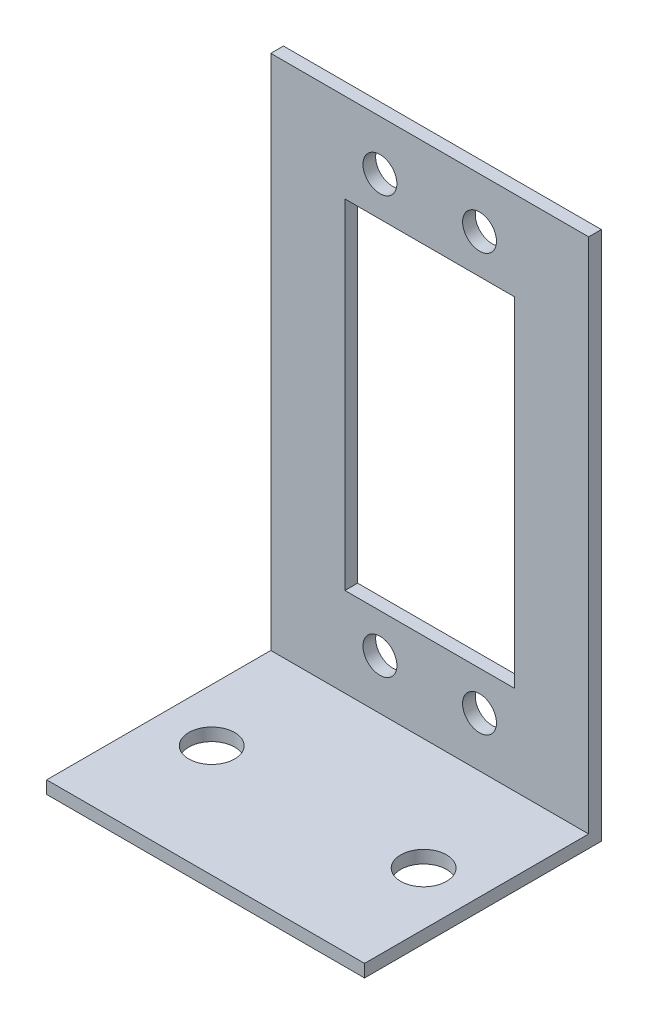
ISO-10303-21;
HEADER;
FILE_DESCRIPTION(('STEP AP214'),'2;1');
FILE_NAME('part.step','',(''),(''),'','','');
FILE_SCHEMA(('AUTOMOTIVE_DESIGN { 1 0 10303 214 1 1 1 1 }'));
ENDSEC;
DATA;
#1=APPLICATION_CONTEXT('core data for automotive mechanical design processes');
#2=APPLICATION_PROTOCOL_DEFINITION('international standard','automotive_design',2000,#1);
#3=PRODUCT_CONTEXT('',#1,'mechanical');
#4=PRODUCT('Part','Part','',(#3));
#5=PRODUCT_RELATED_PRODUCT_CATEGORY('part','',(#4));
#6=PRODUCT_DEFINITION_FORMATION('','',#4);
#7=PRODUCT_DEFINITION_CONTEXT('part definition',#1,'design');
#8=PRODUCT_DEFINITION('design','',#6,#7);
#9=PRODUCT_DEFINITION_SHAPE('','',#8);
#10=(LENGTH_UNIT() NAMED_UNIT(*) SI_UNIT(.MILLI.,.METRE.));
#11=(NAMED_UNIT(*) PLANE_ANGLE_UNIT() SI_UNIT($,.RADIAN.));
#12=(NAMED_UNIT(*) SI_UNIT($,.STERADIAN.) SOLID_ANGLE_UNIT());
#13=UNCERTAINTY_MEASURE_WITH_UNIT(LENGTH_MEASURE(1.E-05),#10,'distance_accuracy_value','');
#14=(GEOMETRIC_REPRESENTATION_CONTEXT(3) GLOBAL_UNCERTAINTY_ASSIGNED_CONTEXT((#13)) GLOBAL_UNIT_ASSIGNED_CONTEXT((#10,
#11,#12)) REPRESENTATION_CONTEXT('',''));
#15=CARTESIAN_POINT('',(0.,0.,0.));
#16=DIRECTION('',(0.,0.,1.));
#17=DIRECTION('',(1.,0.,0.));
#18=AXIS2_PLACEMENT_3D('',#15,#16,#17);
#19=CARTESIAN_POINT('',(19.05,1.51892,0.));
#20=DIRECTION('',(0.,0.,-1.));
#21=DIRECTION('',(0.,1.,0.));
#22=AXIS2_PLACEMENT_3D('',#19,#20,#21);
#23=PLANE('',#22);
#24=DIRECTION('',(0.,-1.,0.));
#25=VECTOR('',#24,1.);
#26=CARTESIAN_POINT('',(-19.05,1.51892,0.));
#27=LINE('',#26,#25);
#28=CARTESIAN_POINT('',(-19.05,1.51892,0.));
#29=VERTEX_POINT('',#28);
#30=CARTESIAN_POINT('',(-19.05,0.,0.));
#31=VERTEX_POINT('',#30);
#32=EDGE_CURVE('E156',#29,#31,#27,.T.);
#33=ORIENTED_EDGE('',*,*,#32,.T.);
#34=DIRECTION('',(-1.,0.,0.));
#35=VECTOR('',#34,1.);
#36=CARTESIAN_POINT('',(19.05,0.,0.));
#37=LINE('',#36,#35);
#38=CARTESIAN_POINT('',(19.05,0.,0.));
#39=VERTEX_POINT('',#38);
#40=EDGE_CURVE('E11',#39,#31,#37,.T.);
#41=ORIENTED_EDGE('',*,*,#40,.F.);
#42=DIRECTION('',(0.,-1.,0.));
#43=VECTOR('',#42,1.);
#44=CARTESIAN_POINT('',(19.05,1.51892,0.));
#45=LINE('',#44,#43);
#46=CARTESIAN_POINT('',(19.05,1.51892,0.));
#47=VERTEX_POINT('',#46);
#48=EDGE_CURVE('E157',#47,#39,#45,.T.);
#49=ORIENTED_EDGE('',*,*,#48,.F.);
#50=DIRECTION('',(-1.,0.,0.));
#51=VECTOR('',#50,1.);
#52=CARTESIAN_POINT('',(19.05,1.51892,0.));
#53=LINE('',#52,#51);
#54=EDGE_CURVE('E171',#47,#29,#53,.T.);
#55=ORIENTED_EDGE('',*,*,#54,.T.);
#56=EDGE_LOOP('',(#33,#41,#49,#55));
#57=FACE_BOUND('',#56,.T.);
#58=ADVANCED_FACE('F32',(#57),#23,.F.);
#59=CARTESIAN_POINT('',(19.05,0.,0.));
#60=DIRECTION('',(0.,1.,0.));
#61=DIRECTION('',(0.,0.,1.));
#62=AXIS2_PLACEMENT_3D('',#59,#60,#61);
#63=PLANE('',#62);
#64=CARTESIAN_POINT('',(-12.7,0.,-13.430846122449));
#65=DIRECTION('',(0.,1.,0.));
#66=DIRECTION('',(0.,0.,1.));
#67=AXIS2_PLACEMENT_3D('',#64,#65,#66);
#68=CIRCLE('',#67,2.75);
#69=CARTESIAN_POINT('',(-12.7,0.,-10.680846122449));
#70=VERTEX_POINT('',#69);
#71=EDGE_CURVE('E147',#70,#70,#68,.T.);
#72=ORIENTED_EDGE('',*,*,#71,.T.);
#73=EDGE_LOOP('',(#72));
#74=FACE_BOUND('',#73,.T.);
#75=CARTESIAN_POINT('',(12.7,0.,-13.430846122449));
#76=DIRECTION('',(0.,1.,0.));
#77=DIRECTION('',(0.,0.,1.));
#78=AXIS2_PLACEMENT_3D('',#75,#76,#77);
#79=CIRCLE('',#78,2.75);
#80=CARTESIAN_POINT('',(12.7,0.,-10.680846122449));
#81=VERTEX_POINT('',#80);
#82=EDGE_CURVE('E153',#81,#81,#79,.T.);
#83=ORIENTED_EDGE('',*,*,#82,.T.);
#84=EDGE_LOOP('',(#83));
#85=FACE_BOUND('',#84,.T.);
#86=DIRECTION('',(0.,0.,-1.));
#87=VECTOR('',#86,1.);
#88=CARTESIAN_POINT('',(-19.05,0.,0.));
#89=LINE('',#88,#87);
#90=CARTESIAN_POINT('',(-19.05,0.,-28.3806122448979));
#91=VERTEX_POINT('',#90);
#92=EDGE_CURVE('E174',#31,#91,#89,.T.);
#93=ORIENTED_EDGE('',*,*,#92,.T.);
#94=DIRECTION('',(-1.,0.,0.));
#95=VECTOR('',#94,1.);
#96=CARTESIAN_POINT('',(19.05,0.,-28.3806122448979));
#97=LINE('',#96,#95);
#98=CARTESIAN_POINT('',(19.05,0.,-28.3806122448979));
#99=VERTEX_POINT('',#98);
#100=EDGE_CURVE('E39',#99,#91,#97,.T.);
#101=ORIENTED_EDGE('',*,*,#100,.F.);
#102=DIRECTION('',(0.,0.,-1.));
#103=VECTOR('',#102,1.);
#104=CARTESIAN_POINT('',(19.05,0.,0.));
#105=LINE('',#104,#103);
#106=EDGE_CURVE('E160',#39,#99,#105,.T.);
#107=ORIENTED_EDGE('',*,*,#106,.F.);
#108=ORIENTED_EDGE('',*,*,#40,.T.);
#109=EDGE_LOOP('',(#93,#101,#107,#108));
#110=FACE_BOUND('',#109,.T.);
#111=ADVANCED_FACE('F219',(#74,#85,#110),#63,.F.);
#112=CARTESIAN_POINT('',(19.05,0.,-28.3806122448979));
#113=DIRECTION('',(0.,0.,1.));
#114=DIRECTION('',(1.,0.,0.));
#115=AXIS2_PLACEMENT_3D('',#112,#113,#114);
#116=PLANE('',#115);
#117=CARTESIAN_POINT('',(5.969,57.50946,-28.3806122448979));
#118=DIRECTION('',(0.,0.,1.));
#119=DIRECTION('',(1.,0.,0.));
#120=AXIS2_PLACEMENT_3D('',#117,#118,#119);
#121=CIRCLE('',#120,2.032);
#122=CARTESIAN_POINT('',(8.001,57.50946,-28.3806122448979));
#123=VERTEX_POINT('',#122);
#124=EDGE_CURVE('E401',#123,#123,#121,.F.);
#125=ORIENTED_EDGE('',*,*,#124,.F.);
#126=EDGE_LOOP('',(#125));
#127=FACE_BOUND('',#126,.T.);
#128=CARTESIAN_POINT('',(-5.969,7.50946000000001,-28.3806122448979));
#129=DIRECTION('',(0.,0.,1.));
#130=DIRECTION('',(1.,0.,0.));
#131=AXIS2_PLACEMENT_3D('',#128,#129,#130);
#132=CIRCLE('',#131,2.032);
#133=CARTESIAN_POINT('',(-3.937,7.50946000000001,-28.3806122448979));
#134=VERTEX_POINT('',#133);
#135=EDGE_CURVE('E402',#134,#134,#132,.F.);
#136=ORIENTED_EDGE('',*,*,#135,.F.);
#137=EDGE_LOOP('',(#136));
#138=FACE_BOUND('',#137,.T.);
#139=CARTESIAN_POINT('',(5.969,7.50946000000001,-28.3806122448979));
#140=DIRECTION('',(0.,0.,1.));
#141=DIRECTION('',(1.,0.,0.));
#142=AXIS2_PLACEMENT_3D('',#139,#140,#141);
#143=CIRCLE('',#142,2.032);
#144=CARTESIAN_POINT('',(8.001,7.50946000000001,-28.3806122448979));
#145=VERTEX_POINT('',#144);
#146=EDGE_CURVE('E409',#145,#145,#143,.F.);
#147=ORIENTED_EDGE('',*,*,#146,.F.);
#148=EDGE_LOOP('',(#147));
#149=FACE_BOUND('',#148,.T.);
#150=CARTESIAN_POINT('',(-5.969,57.50946,-28.3806122448979));
#151=DIRECTION('',(0.,0.,1.));
#152=DIRECTION('',(1.,0.,0.));
#153=AXIS2_PLACEMENT_3D('',#150,#151,#152);
#154=CIRCLE('',#153,2.032);
#155=CARTESIAN_POINT('',(-3.937,57.50946,-28.3806122448979));
#156=VERTEX_POINT('',#155);
#157=EDGE_CURVE('E394',#156,#156,#154,.F.);
#158=ORIENTED_EDGE('',*,*,#157,.F.);
#159=EDGE_LOOP('',(#158));
#160=FACE_BOUND('',#159,.T.);
#161=DIRECTION('',(-1.,0.,0.));
#162=VECTOR('',#161,1.);
#163=CARTESIAN_POINT('',(-10.16,12.18946,-28.3806122448979));
#164=LINE('',#163,#162);
#165=CARTESIAN_POINT('',(10.16,12.18946,-28.3806122448979));
#166=VERTEX_POINT('',#165);
#167=CARTESIAN_POINT('',(-10.16,12.18946,-28.3806122448979));
#168=VERTEX_POINT('',#167);
#169=EDGE_CURVE('E128',#166,#168,#164,.T.);
#170=ORIENTED_EDGE('',*,*,#169,.F.);
#171=DIRECTION('',(0.,-1.,0.));
#172=VECTOR('',#171,1.);
#173=CARTESIAN_POINT('',(10.16,52.82946,-28.3806122448979));
#174=LINE('',#173,#172);
#175=CARTESIAN_POINT('',(10.16,52.82946,-28.3806122448979));
#176=VERTEX_POINT('',#175);
#177=EDGE_CURVE('E110',#176,#166,#174,.T.);
#178=ORIENTED_EDGE('',*,*,#177,.F.);
#179=DIRECTION('',(1.,0.,0.));
#180=VECTOR('',#179,1.);
#181=CARTESIAN_POINT('',(-10.16,52.82946,-28.3806122448979));
#182=LINE('',#181,#180);
#183=CARTESIAN_POINT('',(-10.16,52.82946,-28.3806122448979));
#184=VERTEX_POINT('',#183);
#185=EDGE_CURVE('E119',#184,#176,#182,.T.);
#186=ORIENTED_EDGE('',*,*,#185,.F.);
#187=DIRECTION('',(0.,1.,0.));
#188=VECTOR('',#187,1.);
#189=CARTESIAN_POINT('',(-10.16,52.82946,-28.3806122448979));
#190=LINE('',#189,#188);
#191=EDGE_CURVE('E46',#168,#184,#190,.T.);
#192=ORIENTED_EDGE('',*,*,#191,.F.);
#193=EDGE_LOOP('',(#170,#178,#186,#192));
#194=FACE_BOUND('',#193,.T.);
#195=DIRECTION('',(0.,1.,0.));
#196=VECTOR('',#195,1.);
#197=CARTESIAN_POINT('',(-19.05,0.,-28.3806122448979));
#198=LINE('',#197,#196);
#199=CARTESIAN_POINT('',(-19.05,63.5,-28.3806122448979));
#200=VERTEX_POINT('',#199);
#201=EDGE_CURVE('E176',#91,#200,#198,.T.);
#202=ORIENTED_EDGE('',*,*,#201,.T.);
#203=DIRECTION('',(-1.,0.,0.));
#204=VECTOR('',#203,1.);
#205=CARTESIAN_POINT('',(19.05,63.5,-28.3806122448979));
#206=LINE('',#205,#204);
#207=CARTESIAN_POINT('',(19.05,63.5,-28.3806122448979));
#208=VERTEX_POINT('',#207);
#209=EDGE_CURVE('E191',#208,#200,#206,.T.);
#210=ORIENTED_EDGE('',*,*,#209,.F.);
#211=DIRECTION('',(0.,1.,0.));
#212=VECTOR('',#211,1.);
#213=CARTESIAN_POINT('',(19.05,0.,-28.3806122448979));
#214=LINE('',#213,#212);
#215=EDGE_CURVE('E163',#99,#208,#214,.T.);
#216=ORIENTED_EDGE('',*,*,#215,.F.);
#217=ORIENTED_EDGE('',*,*,#100,.T.);
#218=EDGE_LOOP('',(#202,#210,#216,#217));
#219=FACE_BOUND('',#218,.T.);
#220=ADVANCED_FACE('F125',(#127,#138,#149,#160,#194,#219),#116,.F.);
#221=CARTESIAN_POINT('',(19.05,63.5,-28.3806122448979));
#222=DIRECTION('',(0.,-1.,0.));
#223=DIRECTION('',(0.,0.,-1.));
#224=AXIS2_PLACEMENT_3D('',#221,#222,#223);
#225=PLANE('',#224);
#226=DIRECTION('',(0.,0.,1.));
#227=VECTOR('',#226,1.);
#228=CARTESIAN_POINT('',(-19.05,63.5,-28.3806122448979));
#229=LINE('',#228,#227);
#230=CARTESIAN_POINT('',(-19.05,63.5,-26.8616922448979));
#231=VERTEX_POINT('',#230);
#232=EDGE_CURVE('E178',#200,#231,#229,.T.);
#233=ORIENTED_EDGE('',*,*,#232,.T.);
#234=DIRECTION('',(-1.,0.,0.));
#235=VECTOR('',#234,1.);
#236=CARTESIAN_POINT('',(19.05,63.5,-26.8616922448979));
#237=LINE('',#236,#235);
#238=CARTESIAN_POINT('',(19.05,63.5,-26.8616922448979));
#239=VERTEX_POINT('',#238);
#240=EDGE_CURVE('E188',#239,#231,#237,.T.);
#241=ORIENTED_EDGE('',*,*,#240,.F.);
#242=DIRECTION('',(0.,0.,1.));
#243=VECTOR('',#242,1.);
#244=CARTESIAN_POINT('',(19.05,63.5,-28.3806122448979));
#245=LINE('',#244,#243);
#246=EDGE_CURVE('E165',#208,#239,#245,.T.);
#247=ORIENTED_EDGE('',*,*,#246,.F.);
#248=ORIENTED_EDGE('',*,*,#209,.T.);
#249=EDGE_LOOP('',(#233,#241,#247,#248));
#250=FACE_BOUND('',#249,.T.);
#251=ADVANCED_FACE('F207',(#250),#225,.F.);
#252=CARTESIAN_POINT('',(19.05,63.5,-26.8616922448979));
#253=DIRECTION('',(0.,0.,-1.));
#254=DIRECTION('',(0.,1.,0.));
#255=AXIS2_PLACEMENT_3D('',#252,#253,#254);
#256=PLANE('',#255);
#257=CARTESIAN_POINT('',(5.969,57.50946,-26.8616922448979));
#258=DIRECTION('',(0.,0.,1.));
#259=DIRECTION('',(1.,0.,0.));
#260=AXIS2_PLACEMENT_3D('',#257,#258,#259);
#261=CIRCLE('',#260,2.032);
#262=CARTESIAN_POINT('',(8.001,57.50946,-26.8616922448979));
#263=VERTEX_POINT('',#262);
#264=EDGE_CURVE('E405',#263,#263,#261,.T.);
#265=ORIENTED_EDGE('',*,*,#264,.F.);
#266=EDGE_LOOP('',(#265));
#267=FACE_BOUND('',#266,.T.);
#268=CARTESIAN_POINT('',(-5.969,7.50946000000001,-26.8616922448979));
#269=DIRECTION('',(0.,0.,1.));
#270=DIRECTION('',(-1.,0.,0.));
#271=AXIS2_PLACEMENT_3D('',#268,#269,#270);
#272=CIRCLE('',#271,2.032);
#273=CARTESIAN_POINT('',(-8.001,7.50946000000001,-26.8616922448979));
#274=VERTEX_POINT('',#273);
#275=EDGE_CURVE('E406',#274,#274,#272,.T.);
#276=ORIENTED_EDGE('',*,*,#275,.F.);
#277=EDGE_LOOP('',(#276));
#278=FACE_BOUND('',#277,.T.);
#279=CARTESIAN_POINT('',(5.969,7.50946000000001,-26.8616922448979));
#280=DIRECTION('',(0.,0.,1.));
#281=DIRECTION('',(-1.,0.,0.));
#282=AXIS2_PLACEMENT_3D('',#279,#280,#281);
#283=CIRCLE('',#282,2.032);
#284=CARTESIAN_POINT('',(3.937,7.50946000000001,-26.8616922448979));
#285=VERTEX_POINT('',#284);
#286=EDGE_CURVE('E415',#285,#285,#283,.T.);
#287=ORIENTED_EDGE('',*,*,#286,.F.);
#288=EDGE_LOOP('',(#287));
#289=FACE_BOUND('',#288,.T.);
#290=CARTESIAN_POINT('',(-5.969,57.50946,-26.8616922448979));
#291=DIRECTION('',(0.,0.,1.));
#292=DIRECTION('',(1.,0.,0.));
#293=AXIS2_PLACEMENT_3D('',#290,#291,#292);
#294=CIRCLE('',#293,2.032);
#295=CARTESIAN_POINT('',(-3.937,57.50946,-26.8616922448979));
#296=VERTEX_POINT('',#295);
#297=EDGE_CURVE('E396',#296,#296,#294,.T.);
#298=ORIENTED_EDGE('',*,*,#297,.F.);
#299=EDGE_LOOP('',(#298));
#300=FACE_BOUND('',#299,.T.);
#301=DIRECTION('',(-1.,0.,0.));
#302=VECTOR('',#301,1.);
#303=CARTESIAN_POINT('',(-10.16,52.82946,-26.8616922448979));
#304=LINE('',#303,#302);
#305=CARTESIAN_POINT('',(10.16,52.82946,-26.8616922448979));
#306=VERTEX_POINT('',#305);
#307=CARTESIAN_POINT('',(-10.16,52.82946,-26.8616922448979));
#308=VERTEX_POINT('',#307);
#309=EDGE_CURVE('E130',#306,#308,#304,.T.);
#310=ORIENTED_EDGE('',*,*,#309,.F.);
#311=DIRECTION('',(0.,1.,0.));
#312=VECTOR('',#311,1.);
#313=CARTESIAN_POINT('',(10.16,52.82946,-26.8616922448979));
#314=LINE('',#313,#312);
#315=CARTESIAN_POINT('',(10.16,12.18946,-26.8616922448979));
#316=VERTEX_POINT('',#315);
#317=EDGE_CURVE('E54',#316,#306,#314,.T.);
#318=ORIENTED_EDGE('',*,*,#317,.F.);
#319=DIRECTION('',(1.,0.,0.));
#320=VECTOR('',#319,1.);
#321=CARTESIAN_POINT('',(-10.16,12.18946,-26.8616922448979));
#322=LINE('',#321,#320);
#323=CARTESIAN_POINT('',(-10.16,12.18946,-26.8616922448979));
#324=VERTEX_POINT('',#323);
#325=EDGE_CURVE('E116',#324,#316,#322,.T.);
#326=ORIENTED_EDGE('',*,*,#325,.F.);
#327=DIRECTION('',(0.,-1.,0.));
#328=VECTOR('',#327,1.);
#329=CARTESIAN_POINT('',(-10.16,52.82946,-26.8616922448979));
#330=LINE('',#329,#328);
#331=EDGE_CURVE('E136',#308,#324,#330,.T.);
#332=ORIENTED_EDGE('',*,*,#331,.F.);
#333=EDGE_LOOP('',(#310,#318,#326,#332));
#334=FACE_BOUND('',#333,.T.);
#335=DIRECTION('',(0.,-1.,0.));
#336=VECTOR('',#335,1.);
#337=CARTESIAN_POINT('',(-19.05,63.5,-26.8616922448979));
#338=LINE('',#337,#336);
#339=CARTESIAN_POINT('',(-19.05,1.51892,-26.8616922448979));
#340=VERTEX_POINT('',#339);
#341=EDGE_CURVE('E180',#231,#340,#338,.T.);
#342=ORIENTED_EDGE('',*,*,#341,.T.);
#343=DIRECTION('',(-1.,0.,0.));
#344=VECTOR('',#343,1.);
#345=CARTESIAN_POINT('',(19.05,1.51892,-26.8616922448979));
#346=LINE('',#345,#344);
#347=CARTESIAN_POINT('',(19.05,1.51892,-26.8616922448979));
#348=VERTEX_POINT('',#347);
#349=EDGE_CURVE('E185',#348,#340,#346,.T.);
#350=ORIENTED_EDGE('',*,*,#349,.F.);
#351=DIRECTION('',(0.,-1.,0.));
#352=VECTOR('',#351,1.);
#353=CARTESIAN_POINT('',(19.05,63.5,-26.8616922448979));
#354=LINE('',#353,#352);
#355=EDGE_CURVE('E167',#239,#348,#354,.T.);
#356=ORIENTED_EDGE('',*,*,#355,.F.);
#357=ORIENTED_EDGE('',*,*,#240,.T.);
#358=EDGE_LOOP('',(#342,#350,#356,#357));
#359=FACE_BOUND('',#358,.T.);
#360=ADVANCED_FACE('F211',(#267,#278,#289,#300,#334,#359),#256,.F.);
#361=CARTESIAN_POINT('',(19.05,1.51892,-26.8616922448979));
#362=DIRECTION('',(0.,-1.,0.));
#363=DIRECTION('',(0.,0.,-1.));
#364=AXIS2_PLACEMENT_3D('',#361,#362,#363);
#365=PLANE('',#364);
#366=CARTESIAN_POINT('',(-12.7,1.51892,-13.430846122449));
#367=DIRECTION('',(0.,1.,0.));
#368=DIRECTION('',(0.,0.,1.));
#369=AXIS2_PLACEMENT_3D('',#366,#367,#368);
#370=CIRCLE('',#369,2.75);
#371=CARTESIAN_POINT('',(-12.7,1.51892,-10.680846122449));
#372=VERTEX_POINT('',#371);
#373=EDGE_CURVE('E122',#372,#372,#370,.T.);
#374=ORIENTED_EDGE('',*,*,#373,.F.);
#375=EDGE_LOOP('',(#374));
#376=FACE_BOUND('',#375,.T.);
#377=CARTESIAN_POINT('',(12.7,1.51892,-13.430846122449));
#378=DIRECTION('',(0.,1.,0.));
#379=DIRECTION('',(0.,0.,1.));
#380=AXIS2_PLACEMENT_3D('',#377,#378,#379);
#381=CIRCLE('',#380,2.75);
#382=CARTESIAN_POINT('',(12.7,1.51892,-10.680846122449));
#383=VERTEX_POINT('',#382);
#384=EDGE_CURVE('E150',#383,#383,#381,.T.);
#385=ORIENTED_EDGE('',*,*,#384,.F.);
#386=EDGE_LOOP('',(#385));
#387=FACE_BOUND('',#386,.T.);
#388=DIRECTION('',(0.,0.,1.));
#389=VECTOR('',#388,1.);
#390=CARTESIAN_POINT('',(-19.05,1.51892,-26.8616922448979));
#391=LINE('',#390,#389);
#392=EDGE_CURVE('E161',#340,#29,#391,.T.);
#393=ORIENTED_EDGE('',*,*,#392,.T.);
#394=ORIENTED_EDGE('',*,*,#54,.F.);
#395=DIRECTION('',(0.,0.,1.));
#396=VECTOR('',#395,1.);
#397=CARTESIAN_POINT('',(19.05,1.51892,-26.8616922448979));
#398=LINE('',#397,#396);
#399=EDGE_CURVE('E169',#348,#47,#398,.T.);
#400=ORIENTED_EDGE('',*,*,#399,.F.);
#401=ORIENTED_EDGE('',*,*,#349,.T.);
#402=EDGE_LOOP('',(#393,#394,#400,#401));
#403=FACE_BOUND('',#402,.T.);
#404=ADVANCED_FACE('F222',(#376,#387,#403),#365,.F.);
#405=CARTESIAN_POINT('',(19.05,0.,0.));
#406=DIRECTION('',(1.,0.,0.));
#407=DIRECTION('',(0.,0.,-1.));
#408=AXIS2_PLACEMENT_3D('',#405,#406,#407);
#409=PLANE('',#408);
#410=ORIENTED_EDGE('',*,*,#48,.T.);
#411=ORIENTED_EDGE('',*,*,#106,.T.);
#412=ORIENTED_EDGE('',*,*,#215,.T.);
#413=ORIENTED_EDGE('',*,*,#246,.T.);
#414=ORIENTED_EDGE('',*,*,#355,.T.);
#415=ORIENTED_EDGE('',*,*,#399,.T.);
#416=EDGE_LOOP('',(#410,#411,#412,#413,#414,#415));
#417=FACE_BOUND('',#416,.T.);
#418=ADVANCED_FACE('F215',(#417),#409,.T.);
#419=CARTESIAN_POINT('',(-19.05,0.,0.));
#420=DIRECTION('',(1.,0.,0.));
#421=DIRECTION('',(0.,0.,-1.));
#422=AXIS2_PLACEMENT_3D('',#419,#420,#421);
#423=PLANE('',#422);
#424=ORIENTED_EDGE('',*,*,#32,.F.);
#425=ORIENTED_EDGE('',*,*,#392,.F.);
#426=ORIENTED_EDGE('',*,*,#341,.F.);
#427=ORIENTED_EDGE('',*,*,#232,.F.);
#428=ORIENTED_EDGE('',*,*,#201,.F.);
#429=ORIENTED_EDGE('',*,*,#92,.F.);
#430=EDGE_LOOP('',(#424,#425,#426,#427,#428,#429));
#431=FACE_BOUND('',#430,.T.);
#432=ADVANCED_FACE('F202',(#431),#423,.F.);
#433=CARTESIAN_POINT('',(12.7,1.51892,-13.430846122449));
#434=DIRECTION('',(0.,1.,0.));
#435=DIRECTION('',(0.,0.,1.));
#436=AXIS2_PLACEMENT_3D('',#433,#434,#435);
#437=CYLINDRICAL_SURFACE('',#436,2.75);
#438=ORIENTED_EDGE('',*,*,#82,.F.);
#439=EDGE_LOOP('',(#438));
#440=FACE_BOUND('',#439,.T.);
#441=ORIENTED_EDGE('',*,*,#384,.T.);
#442=EDGE_LOOP('',(#441));
#443=FACE_BOUND('',#442,.T.);
#444=ADVANCED_FACE('F324',(#440,#443),#437,.F.);
#445=CARTESIAN_POINT('',(-12.7,1.51892,-13.430846122449));
#446=DIRECTION('',(0.,1.,0.));
#447=DIRECTION('',(0.,0.,1.));
#448=AXIS2_PLACEMENT_3D('',#445,#446,#447);
#449=CYLINDRICAL_SURFACE('',#448,2.75);
#450=ORIENTED_EDGE('',*,*,#71,.F.);
#451=EDGE_LOOP('',(#450));
#452=FACE_BOUND('',#451,.T.);
#453=ORIENTED_EDGE('',*,*,#373,.T.);
#454=EDGE_LOOP('',(#453));
#455=FACE_BOUND('',#454,.T.);
#456=ADVANCED_FACE('F321',(#452,#455),#449,.F.);
#457=CARTESIAN_POINT('',(10.16,52.82946,-28.3816122448979));
#458=DIRECTION('',(1.,0.,0.));
#459=DIRECTION('',(0.,1.,0.));
#460=AXIS2_PLACEMENT_3D('',#457,#458,#459);
#461=PLANE('',#460);
#462=ORIENTED_EDGE('',*,*,#177,.T.);
#463=DIRECTION('',(0.,0.,1.));
#464=VECTOR('',#463,1.);
#465=CARTESIAN_POINT('',(10.16,12.18946,-28.3816122448979));
#466=LINE('',#465,#464);
#467=EDGE_CURVE('E123',#166,#316,#466,.T.);
#468=ORIENTED_EDGE('',*,*,#467,.T.);
#469=ORIENTED_EDGE('',*,*,#317,.T.);
#470=DIRECTION('',(0.,0.,1.));
#471=VECTOR('',#470,1.);
#472=CARTESIAN_POINT('',(10.16,52.82946,-28.3816122448979));
#473=LINE('',#472,#471);
#474=EDGE_CURVE('E106',#176,#306,#473,.T.);
#475=ORIENTED_EDGE('',*,*,#474,.F.);
#476=EDGE_LOOP('',(#462,#468,#469,#475));
#477=FACE_BOUND('',#476,.T.);
#478=ADVANCED_FACE('F108',(#477),#461,.F.);
#479=CARTESIAN_POINT('',(-10.16,12.18946,-28.3816122448979));
#480=DIRECTION('',(0.,-1.,0.));
#481=DIRECTION('',(0.,0.,-1.));
#482=AXIS2_PLACEMENT_3D('',#479,#480,#481);
#483=PLANE('',#482);
#484=ORIENTED_EDGE('',*,*,#169,.T.);
#485=DIRECTION('',(0.,0.,1.));
#486=VECTOR('',#485,1.);
#487=CARTESIAN_POINT('',(-10.16,12.18946,-28.3816122448979));
#488=LINE('',#487,#486);
#489=EDGE_CURVE('E142',#168,#324,#488,.T.);
#490=ORIENTED_EDGE('',*,*,#489,.T.);
#491=ORIENTED_EDGE('',*,*,#325,.T.);
#492=ORIENTED_EDGE('',*,*,#467,.F.);
#493=EDGE_LOOP('',(#484,#490,#491,#492));
#494=FACE_BOUND('',#493,.T.);
#495=ADVANCED_FACE('F311',(#494),#483,.F.);
#496=CARTESIAN_POINT('',(-10.16,52.82946,-28.3816122448979));
#497=DIRECTION('',(-1.,0.,0.));
#498=DIRECTION('',(0.,-1.,0.));
#499=AXIS2_PLACEMENT_3D('',#496,#497,#498);
#500=PLANE('',#499);
#501=ORIENTED_EDGE('',*,*,#191,.T.);
#502=DIRECTION('',(0.,0.,1.));
#503=VECTOR('',#502,1.);
#504=CARTESIAN_POINT('',(-10.16,52.82946,-28.3816122448979));
#505=LINE('',#504,#503);
#506=EDGE_CURVE('E115',#184,#308,#505,.T.);
#507=ORIENTED_EDGE('',*,*,#506,.T.);
#508=ORIENTED_EDGE('',*,*,#331,.T.);
#509=ORIENTED_EDGE('',*,*,#489,.F.);
#510=EDGE_LOOP('',(#501,#507,#508,#509));
#511=FACE_BOUND('',#510,.T.);
#512=ADVANCED_FACE('F314',(#511),#500,.F.);
#513=CARTESIAN_POINT('',(-10.16,52.82946,-28.3816122448979));
#514=DIRECTION('',(0.,1.,0.));
#515=DIRECTION('',(0.,0.,1.));
#516=AXIS2_PLACEMENT_3D('',#513,#514,#515);
#517=PLANE('',#516);
#518=ORIENTED_EDGE('',*,*,#185,.T.);
#519=ORIENTED_EDGE('',*,*,#474,.T.);
#520=ORIENTED_EDGE('',*,*,#309,.T.);
#521=ORIENTED_EDGE('',*,*,#506,.F.);
#522=EDGE_LOOP('',(#518,#519,#520,#521));
#523=FACE_BOUND('',#522,.T.);
#524=ADVANCED_FACE('F120',(#523),#517,.F.);
#525=CARTESIAN_POINT('',(-5.969,57.50946,-28.3816122448979));
#526=DIRECTION('',(0.,0.,1.));
#527=DIRECTION('',(1.,0.,0.));
#528=AXIS2_PLACEMENT_3D('',#525,#526,#527);
#529=CYLINDRICAL_SURFACE('',#528,2.032);
#530=ORIENTED_EDGE('',*,*,#297,.T.);
#531=EDGE_LOOP('',(#530));
#532=FACE_BOUND('',#531,.T.);
#533=ORIENTED_EDGE('',*,*,#157,.T.);
#534=EDGE_LOOP('',(#533));
#535=FACE_BOUND('',#534,.T.);
#536=ADVANCED_FACE('F267',(#532,#535),#529,.F.);
#537=CARTESIAN_POINT('',(5.969,7.50946000000001,-28.3816122448979));
#538=DIRECTION('',(0.,0.,1.));
#539=DIRECTION('',(1.,0.,0.));
#540=AXIS2_PLACEMENT_3D('',#537,#538,#539);
#541=CYLINDRICAL_SURFACE('',#540,2.032);
#542=ORIENTED_EDGE('',*,*,#286,.T.);
#543=EDGE_LOOP('',(#542));
#544=FACE_BOUND('',#543,.T.);
#545=ORIENTED_EDGE('',*,*,#146,.T.);
#546=EDGE_LOOP('',(#545));
#547=FACE_BOUND('',#546,.T.);
#548=ADVANCED_FACE('F272',(#544,#547),#541,.F.);
#549=CARTESIAN_POINT('',(-5.969,7.50946000000001,-28.3816122448979));
#550=DIRECTION('',(0.,0.,1.));
#551=DIRECTION('',(1.,0.,0.));
#552=AXIS2_PLACEMENT_3D('',#549,#550,#551);
#553=CYLINDRICAL_SURFACE('',#552,2.032);
#554=ORIENTED_EDGE('',*,*,#275,.T.);
#555=EDGE_LOOP('',(#554));
#556=FACE_BOUND('',#555,.T.);
#557=ORIENTED_EDGE('',*,*,#135,.T.);
#558=EDGE_LOOP('',(#557));
#559=FACE_BOUND('',#558,.T.);
#560=ADVANCED_FACE('F284',(#556,#559),#553,.F.);
#561=CARTESIAN_POINT('',(5.969,57.50946,-28.3816122448979));
#562=DIRECTION('',(0.,0.,1.));
#563=DIRECTION('',(1.,0.,0.));
#564=AXIS2_PLACEMENT_3D('',#561,#562,#563);
#565=CYLINDRICAL_SURFACE('',#564,2.032);
#566=ORIENTED_EDGE('',*,*,#264,.T.);
#567=EDGE_LOOP('',(#566));
#568=FACE_BOUND('',#567,.T.);
#569=ORIENTED_EDGE('',*,*,#124,.T.);
#570=EDGE_LOOP('',(#569));
#571=FACE_BOUND('',#570,.T.);
#572=ADVANCED_FACE('F294',(#568,#571),#565,.F.);
#573=CLOSED_SHELL('',(#58,#111,#220,#251,#360,#404,#418,#432,#444,#456,#478,#495,#512,#524,#536,
#548,#560,#572));
#574=MANIFOLD_SOLID_BREP('B2',#573);
#575=ADVANCED_BREP_SHAPE_REPRESENTATION('',(#18,#574),#14);
#576=SHAPE_DEFINITION_REPRESENTATION(#9,#575);
ENDSEC;
END-ISO-10303-21;
